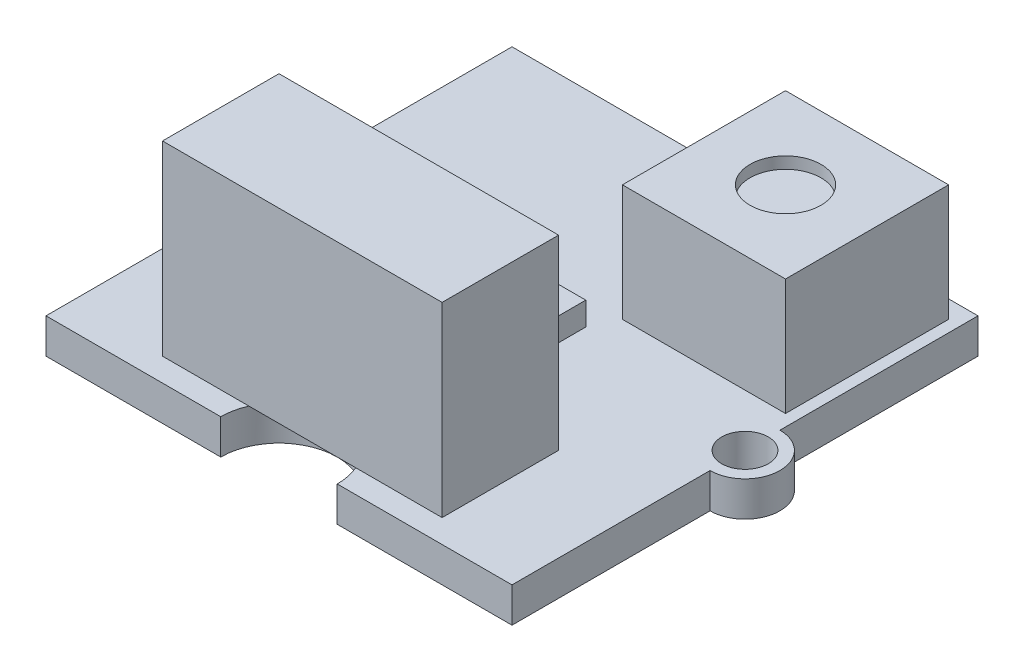
ISO-10303-21;
HEADER;
FILE_DESCRIPTION(('STEP AP214'),'2;1');
FILE_NAME('part.step','',(''),(''),'','','');
FILE_SCHEMA(('AUTOMOTIVE_DESIGN { 1 0 10303 214 1 1 1 1 }'));
ENDSEC;
DATA;
#1=APPLICATION_CONTEXT('core data for automotive mechanical design processes');
#2=APPLICATION_PROTOCOL_DEFINITION('international standard','automotive_design',2000,#1);
#3=PRODUCT_CONTEXT('',#1,'mechanical');
#4=PRODUCT('Part','Part','',(#3));
#5=PRODUCT_RELATED_PRODUCT_CATEGORY('part','',(#4));
#6=PRODUCT_DEFINITION_FORMATION('','',#4);
#7=PRODUCT_DEFINITION_CONTEXT('part definition',#1,'design');
#8=PRODUCT_DEFINITION('design','',#6,#7);
#9=PRODUCT_DEFINITION_SHAPE('','',#8);
#10=(LENGTH_UNIT() NAMED_UNIT(*) SI_UNIT(.MILLI.,.METRE.));
#11=(NAMED_UNIT(*) PLANE_ANGLE_UNIT() SI_UNIT($,.RADIAN.));
#12=(NAMED_UNIT(*) SI_UNIT($,.STERADIAN.) SOLID_ANGLE_UNIT());
#13=UNCERTAINTY_MEASURE_WITH_UNIT(LENGTH_MEASURE(1.E-05),#10,'distance_accuracy_value','');
#14=(GEOMETRIC_REPRESENTATION_CONTEXT(3) GLOBAL_UNCERTAINTY_ASSIGNED_CONTEXT((#13)) GLOBAL_UNIT_ASSIGNED_CONTEXT((#10,
#11,#12)) REPRESENTATION_CONTEXT('',''));
#15=CARTESIAN_POINT('',(0.,0.,0.));
#16=DIRECTION('',(0.,0.,1.));
#17=DIRECTION('',(1.,0.,0.));
#18=AXIS2_PLACEMENT_3D('',#15,#16,#17);
#19=CARTESIAN_POINT('',(0.,1.5,0.));
#20=DIRECTION('',(0.,1.,0.));
#21=DIRECTION('',(0.,0.,1.));
#22=AXIS2_PLACEMENT_3D('',#19,#20,#21);
#23=PLANE('',#22);
#24=DIRECTION('',(1.,0.,0.));
#25=VECTOR('',#24,1.);
#26=CARTESIAN_POINT('',(-6.,1.5,9.));
#27=LINE('',#26,#25);
#28=CARTESIAN_POINT('',(2.29128784747792,1.5,9.));
#29=VERTEX_POINT('',#28);
#30=CARTESIAN_POINT('',(6.,1.5,9.));
#31=VERTEX_POINT('',#30);
#32=EDGE_CURVE('E11',#29,#31,#27,.T.);
#33=ORIENTED_EDGE('',*,*,#32,.F.);
#34=CARTESIAN_POINT('',(0.,1.5,10.));
#35=DIRECTION('',(0.,1.,0.));
#36=DIRECTION('',(0.,0.,1.));
#37=AXIS2_PLACEMENT_3D('',#34,#35,#36);
#38=CIRCLE('',#37,2.5);
#39=CARTESIAN_POINT('',(2.5,1.5,10.));
#40=VERTEX_POINT('',#39);
#41=EDGE_CURVE('E301',#40,#29,#38,.T.);
#42=ORIENTED_EDGE('',*,*,#41,.F.);
#43=DIRECTION('',(1.,0.,0.));
#44=VECTOR('',#43,1.);
#45=CARTESIAN_POINT('',(-10.,1.5,10.));
#46=LINE('',#45,#44);
#47=CARTESIAN_POINT('',(10.,1.5,10.));
#48=VERTEX_POINT('',#47);
#49=EDGE_CURVE('E363',#40,#48,#46,.T.);
#50=ORIENTED_EDGE('',*,*,#49,.T.);
#51=DIRECTION('',(0.,0.,-1.));
#52=VECTOR('',#51,1.);
#53=CARTESIAN_POINT('',(10.,1.5,-10.));
#54=LINE('',#53,#52);
#55=CARTESIAN_POINT('',(10.,1.5,1.5));
#56=VERTEX_POINT('',#55);
#57=EDGE_CURVE('E351',#48,#56,#54,.T.);
#58=ORIENTED_EDGE('',*,*,#57,.T.);
#59=CARTESIAN_POINT('',(10.,1.5,0.));
#60=DIRECTION('',(0.,1.,0.));
#61=DIRECTION('',(0.,0.,1.));
#62=AXIS2_PLACEMENT_3D('',#59,#60,#61);
#63=CIRCLE('',#62,1.5);
#64=CARTESIAN_POINT('',(10.,1.5,-1.5));
#65=VERTEX_POINT('',#64);
#66=EDGE_CURVE('E328',#56,#65,#63,.T.);
#67=ORIENTED_EDGE('',*,*,#66,.T.);
#68=CARTESIAN_POINT('',(10.,1.5,-10.));
#69=VERTEX_POINT('',#68);
#70=EDGE_CURVE('E355',#65,#69,#54,.T.);
#71=ORIENTED_EDGE('',*,*,#70,.T.);
#72=DIRECTION('',(-1.,0.,0.));
#73=VECTOR('',#72,1.);
#74=CARTESIAN_POINT('',(-10.,1.5,-10.));
#75=LINE('',#74,#73);
#76=CARTESIAN_POINT('',(2.5,1.5,-10.));
#77=VERTEX_POINT('',#76);
#78=EDGE_CURVE('E356',#69,#77,#75,.T.);
#79=ORIENTED_EDGE('',*,*,#78,.T.);
#80=CARTESIAN_POINT('',(0.,1.5,-10.));
#81=DIRECTION('',(0.,1.,0.));
#82=DIRECTION('',(0.,0.,1.));
#83=AXIS2_PLACEMENT_3D('',#80,#81,#82);
#84=CIRCLE('',#83,2.5);
#85=CARTESIAN_POINT('',(-2.5,1.5,-10.));
#86=VERTEX_POINT('',#85);
#87=EDGE_CURVE('E310',#86,#77,#84,.T.);
#88=ORIENTED_EDGE('',*,*,#87,.F.);
#89=CARTESIAN_POINT('',(-10.,1.5,-10.));
#90=VERTEX_POINT('',#89);
#91=EDGE_CURVE('E354',#86,#90,#75,.T.);
#92=ORIENTED_EDGE('',*,*,#91,.T.);
#93=DIRECTION('',(0.,0.,1.));
#94=VECTOR('',#93,1.);
#95=CARTESIAN_POINT('',(-10.,1.5,-10.));
#96=LINE('',#95,#94);
#97=CARTESIAN_POINT('',(-10.,1.5,-1.5));
#98=VERTEX_POINT('',#97);
#99=EDGE_CURVE('E360',#90,#98,#96,.T.);
#100=ORIENTED_EDGE('',*,*,#99,.T.);
#101=CARTESIAN_POINT('',(-10.,1.5,0.));
#102=DIRECTION('',(0.,1.,0.));
#103=DIRECTION('',(0.,0.,1.));
#104=AXIS2_PLACEMENT_3D('',#101,#102,#103);
#105=CIRCLE('',#104,1.5);
#106=CARTESIAN_POINT('',(-10.,1.5,1.5));
#107=VERTEX_POINT('',#106);
#108=EDGE_CURVE('E340',#98,#107,#105,.T.);
#109=ORIENTED_EDGE('',*,*,#108,.T.);
#110=CARTESIAN_POINT('',(-10.,1.5,10.));
#111=VERTEX_POINT('',#110);
#112=EDGE_CURVE('E359',#107,#111,#96,.T.);
#113=ORIENTED_EDGE('',*,*,#112,.T.);
#114=CARTESIAN_POINT('',(-2.5,1.5,10.));
#115=VERTEX_POINT('',#114);
#116=EDGE_CURVE('E364',#111,#115,#46,.T.);
#117=ORIENTED_EDGE('',*,*,#116,.T.);
#118=CARTESIAN_POINT('',(-2.29128784747792,1.5,9.));
#119=VERTEX_POINT('',#118);
#120=EDGE_CURVE('E296',#119,#115,#38,.T.);
#121=ORIENTED_EDGE('',*,*,#120,.F.);
#122=CARTESIAN_POINT('',(-6.,1.5,9.));
#123=VERTEX_POINT('',#122);
#124=EDGE_CURVE('E42',#123,#119,#27,.T.);
#125=ORIENTED_EDGE('',*,*,#124,.F.);
#126=DIRECTION('',(0.,0.,1.));
#127=VECTOR('',#126,1.);
#128=CARTESIAN_POINT('',(-6.,1.5,4.));
#129=LINE('',#128,#127);
#130=CARTESIAN_POINT('',(-6.,1.5,4.));
#131=VERTEX_POINT('',#130);
#132=EDGE_CURVE('E281',#131,#123,#129,.T.);
#133=ORIENTED_EDGE('',*,*,#132,.F.);
#134=DIRECTION('',(-1.,0.,0.));
#135=VECTOR('',#134,1.);
#136=CARTESIAN_POINT('',(-6.,1.5,4.));
#137=LINE('',#136,#135);
#138=CARTESIAN_POINT('',(6.,1.5,4.));
#139=VERTEX_POINT('',#138);
#140=EDGE_CURVE('E278',#139,#131,#137,.T.);
#141=ORIENTED_EDGE('',*,*,#140,.F.);
#142=DIRECTION('',(0.,0.,-1.));
#143=VECTOR('',#142,1.);
#144=CARTESIAN_POINT('',(6.,1.5,4.));
#145=LINE('',#144,#143);
#146=EDGE_CURVE('E265',#31,#139,#145,.T.);
#147=ORIENTED_EDGE('',*,*,#146,.F.);
#148=EDGE_LOOP('',(#33,#42,#50,#58,#67,#71,#79,#88,#92,#100,#109,#113,#117,#121,#125,#133,#141,#147));
#149=FACE_BOUND('',#148,.T.);
#150=CARTESIAN_POINT('',(10.,1.5,0.));
#151=DIRECTION('',(0.,1.,0.));
#152=DIRECTION('',(0.,0.,1.));
#153=AXIS2_PLACEMENT_3D('',#150,#151,#152);
#154=CIRCLE('',#153,1.);
#155=CARTESIAN_POINT('',(10.,1.5,0.999999999999996));
#156=VERTEX_POINT('',#155);
#157=EDGE_CURVE('E318',#156,#156,#154,.T.);
#158=ORIENTED_EDGE('',*,*,#157,.F.);
#159=EDGE_LOOP('',(#158));
#160=FACE_BOUND('',#159,.T.);
#161=CARTESIAN_POINT('',(-10.,1.5,0.));
#162=DIRECTION('',(0.,1.,0.));
#163=DIRECTION('',(0.,0.,1.));
#164=AXIS2_PLACEMENT_3D('',#161,#162,#163);
#165=CIRCLE('',#164,1.);
#166=CARTESIAN_POINT('',(-10.,1.5,0.999999999999996));
#167=VERTEX_POINT('',#166);
#168=EDGE_CURVE('E322',#167,#167,#165,.T.);
#169=ORIENTED_EDGE('',*,*,#168,.F.);
#170=EDGE_LOOP('',(#169));
#171=FACE_BOUND('',#170,.T.);
#172=DIRECTION('',(-1.,0.,0.));
#173=VECTOR('',#172,1.);
#174=CARTESIAN_POINT('',(2.5,1.5,-9.23875388606364));
#175=LINE('',#174,#173);
#176=CARTESIAN_POINT('',(9.5,1.5,-9.23875388606364));
#177=VERTEX_POINT('',#176);
#178=CARTESIAN_POINT('',(2.5,1.5,-9.23875388606364));
#179=VERTEX_POINT('',#178);
#180=EDGE_CURVE('E252',#177,#179,#175,.T.);
#181=ORIENTED_EDGE('',*,*,#180,.F.);
#182=DIRECTION('',(0.,0.,-1.));
#183=VECTOR('',#182,1.);
#184=CARTESIAN_POINT('',(9.5,1.5,-9.23875388606364));
#185=LINE('',#184,#183);
#186=CARTESIAN_POINT('',(9.5,1.5,-2.23875388606364));
#187=VERTEX_POINT('',#186);
#188=EDGE_CURVE('E237',#187,#177,#185,.T.);
#189=ORIENTED_EDGE('',*,*,#188,.F.);
#190=DIRECTION('',(1.,0.,0.));
#191=VECTOR('',#190,1.);
#192=CARTESIAN_POINT('',(2.5,1.5,-2.23875388606364));
#193=LINE('',#192,#191);
#194=CARTESIAN_POINT('',(2.5,1.5,-2.23875388606364));
#195=VERTEX_POINT('',#194);
#196=EDGE_CURVE('E243',#195,#187,#193,.T.);
#197=ORIENTED_EDGE('',*,*,#196,.F.);
#198=DIRECTION('',(0.,0.,1.));
#199=VECTOR('',#198,1.);
#200=CARTESIAN_POINT('',(2.5,1.5,-9.23875388606364));
#201=LINE('',#200,#199);
#202=EDGE_CURVE('E254',#179,#195,#201,.T.);
#203=ORIENTED_EDGE('',*,*,#202,.F.);
#204=EDGE_LOOP('',(#181,#189,#197,#203));
#205=FACE_BOUND('',#204,.T.);
#206=DIRECTION('',(-1.,0.,0.));
#207=VECTOR('',#206,1.);
#208=CARTESIAN_POINT('',(-3.,1.5,-1.16720873507012));
#209=LINE('',#208,#207);
#210=CARTESIAN_POINT('',(2.,1.5,-1.16720873507012));
#211=VERTEX_POINT('',#210);
#212=CARTESIAN_POINT('',(-3.,1.5,-1.16720873507012));
#213=VERTEX_POINT('',#212);
#214=EDGE_CURVE('E749',#211,#213,#209,.T.);
#215=ORIENTED_EDGE('',*,*,#214,.F.);
#216=DIRECTION('',(0.,0.,-1.));
#217=VECTOR('',#216,1.);
#218=CARTESIAN_POINT('',(2.,1.5,-1.16720873507012));
#219=LINE('',#218,#217);
#220=CARTESIAN_POINT('',(2.,1.5,2.33279126492988));
#221=VERTEX_POINT('',#220);
#222=EDGE_CURVE('E226',#221,#211,#219,.T.);
#223=ORIENTED_EDGE('',*,*,#222,.F.);
#224=DIRECTION('',(1.,0.,0.));
#225=VECTOR('',#224,1.);
#226=CARTESIAN_POINT('',(-3.,1.5,2.33279126492988));
#227=LINE('',#226,#225);
#228=CARTESIAN_POINT('',(-3.,1.5,2.33279126492988));
#229=VERTEX_POINT('',#228);
#230=EDGE_CURVE('E222',#229,#221,#227,.T.);
#231=ORIENTED_EDGE('',*,*,#230,.F.);
#232=DIRECTION('',(0.,0.,1.));
#233=VECTOR('',#232,1.);
#234=CARTESIAN_POINT('',(-3.,1.5,-1.16720873507012));
#235=LINE('',#234,#233);
#236=EDGE_CURVE('E746',#213,#229,#235,.T.);
#237=ORIENTED_EDGE('',*,*,#236,.F.);
#238=EDGE_LOOP('',(#215,#223,#231,#237));
#239=FACE_BOUND('',#238,.T.);
#240=ADVANCED_FACE('F32',(#149,#160,#171,#205,#239),#23,.T.);
#241=CARTESIAN_POINT('',(-10.,1.5,10.));
#242=DIRECTION('',(0.,0.,-1.));
#243=DIRECTION('',(-1.,0.,0.));
#244=AXIS2_PLACEMENT_3D('',#241,#242,#243);
#245=PLANE('',#244);
#246=DIRECTION('',(1.,0.,0.));
#247=VECTOR('',#246,1.);
#248=CARTESIAN_POINT('',(-10.,0.,10.));
#249=LINE('',#248,#247);
#250=CARTESIAN_POINT('',(-10.,0.,10.));
#251=VERTEX_POINT('',#250);
#252=CARTESIAN_POINT('',(-2.5,0.,10.));
#253=VERTEX_POINT('',#252);
#254=EDGE_CURVE('E380',#251,#253,#249,.T.);
#255=ORIENTED_EDGE('',*,*,#254,.T.);
#256=DIRECTION('',(0.,1.,0.));
#257=VECTOR('',#256,1.);
#258=CARTESIAN_POINT('',(-2.5,0.,10.));
#259=LINE('',#258,#257);
#260=EDGE_CURVE('E307',#253,#115,#259,.T.);
#261=ORIENTED_EDGE('',*,*,#260,.T.);
#262=ORIENTED_EDGE('',*,*,#116,.F.);
#263=DIRECTION('',(0.,-1.,0.));
#264=VECTOR('',#263,1.);
#265=CARTESIAN_POINT('',(-10.,1.5,10.));
#266=LINE('',#265,#264);
#267=EDGE_CURVE('E385',#111,#251,#266,.T.);
#268=ORIENTED_EDGE('',*,*,#267,.T.);
#269=EDGE_LOOP('',(#255,#261,#262,#268));
#270=FACE_BOUND('',#269,.T.);
#271=ADVANCED_FACE('F426',(#270),#245,.F.);
#272=CARTESIAN_POINT('',(-10.,1.5,-10.));
#273=DIRECTION('',(0.,0.,1.));
#274=DIRECTION('',(1.,0.,0.));
#275=AXIS2_PLACEMENT_3D('',#272,#273,#274);
#276=PLANE('',#275);
#277=DIRECTION('',(-1.,0.,0.));
#278=VECTOR('',#277,1.);
#279=CARTESIAN_POINT('',(-10.,0.,-10.));
#280=LINE('',#279,#278);
#281=CARTESIAN_POINT('',(10.,0.,-10.));
#282=VERTEX_POINT('',#281);
#283=CARTESIAN_POINT('',(2.5,0.,-10.));
#284=VERTEX_POINT('',#283);
#285=EDGE_CURVE('E372',#282,#284,#280,.T.);
#286=ORIENTED_EDGE('',*,*,#285,.T.);
#287=DIRECTION('',(0.,1.,0.));
#288=VECTOR('',#287,1.);
#289=CARTESIAN_POINT('',(2.5,0.,-10.));
#290=LINE('',#289,#288);
#291=EDGE_CURVE('E315',#284,#77,#290,.T.);
#292=ORIENTED_EDGE('',*,*,#291,.T.);
#293=ORIENTED_EDGE('',*,*,#78,.F.);
#294=DIRECTION('',(0.,-1.,0.));
#295=VECTOR('',#294,1.);
#296=CARTESIAN_POINT('',(10.,1.5,-10.));
#297=LINE('',#296,#295);
#298=EDGE_CURVE('E390',#69,#282,#297,.T.);
#299=ORIENTED_EDGE('',*,*,#298,.T.);
#300=EDGE_LOOP('',(#286,#292,#293,#299));
#301=FACE_BOUND('',#300,.T.);
#302=ADVANCED_FACE('F404',(#301),#276,.F.);
#303=CARTESIAN_POINT('',(10.,1.5,-10.));
#304=DIRECTION('',(-1.,0.,0.));
#305=DIRECTION('',(0.,0.,1.));
#306=AXIS2_PLACEMENT_3D('',#303,#304,#305);
#307=PLANE('',#306);
#308=DIRECTION('',(0.,0.,-1.));
#309=VECTOR('',#308,1.);
#310=CARTESIAN_POINT('',(10.,0.,-10.));
#311=LINE('',#310,#309);
#312=CARTESIAN_POINT('',(10.,0.,10.));
#313=VERTEX_POINT('',#312);
#314=CARTESIAN_POINT('',(10.,0.,1.5));
#315=VERTEX_POINT('',#314);
#316=EDGE_CURVE('E368',#313,#315,#311,.T.);
#317=ORIENTED_EDGE('',*,*,#316,.T.);
#318=DIRECTION('',(0.,1.,0.));
#319=VECTOR('',#318,1.);
#320=CARTESIAN_POINT('',(10.,0.,1.5));
#321=LINE('',#320,#319);
#322=EDGE_CURVE('E337',#315,#56,#321,.T.);
#323=ORIENTED_EDGE('',*,*,#322,.T.);
#324=ORIENTED_EDGE('',*,*,#57,.F.);
#325=DIRECTION('',(0.,-1.,0.));
#326=VECTOR('',#325,1.);
#327=CARTESIAN_POINT('',(10.,1.5,10.));
#328=LINE('',#327,#326);
#329=EDGE_CURVE('E367',#48,#313,#328,.T.);
#330=ORIENTED_EDGE('',*,*,#329,.T.);
#331=EDGE_LOOP('',(#317,#323,#324,#330));
#332=FACE_BOUND('',#331,.T.);
#333=ADVANCED_FACE('F416',(#332),#307,.F.);
#334=CARTESIAN_POINT('',(-10.,1.5,-10.));
#335=DIRECTION('',(1.,0.,0.));
#336=DIRECTION('',(0.,0.,-1.));
#337=AXIS2_PLACEMENT_3D('',#334,#335,#336);
#338=PLANE('',#337);
#339=DIRECTION('',(0.,0.,1.));
#340=VECTOR('',#339,1.);
#341=CARTESIAN_POINT('',(-10.,0.,-10.));
#342=LINE('',#341,#340);
#343=CARTESIAN_POINT('',(-10.,0.,-10.));
#344=VERTEX_POINT('',#343);
#345=CARTESIAN_POINT('',(-10.,0.,-1.5));
#346=VERTEX_POINT('',#345);
#347=EDGE_CURVE('E376',#344,#346,#342,.T.);
#348=ORIENTED_EDGE('',*,*,#347,.T.);
#349=DIRECTION('',(0.,1.,0.));
#350=VECTOR('',#349,1.);
#351=CARTESIAN_POINT('',(-10.,0.,-1.5));
#352=LINE('',#351,#350);
#353=EDGE_CURVE('E347',#346,#98,#352,.T.);
#354=ORIENTED_EDGE('',*,*,#353,.T.);
#355=ORIENTED_EDGE('',*,*,#99,.F.);
#356=DIRECTION('',(0.,-1.,0.));
#357=VECTOR('',#356,1.);
#358=CARTESIAN_POINT('',(-10.,1.5,-10.));
#359=LINE('',#358,#357);
#360=EDGE_CURVE('E388',#90,#344,#359,.T.);
#361=ORIENTED_EDGE('',*,*,#360,.T.);
#362=EDGE_LOOP('',(#348,#354,#355,#361));
#363=FACE_BOUND('',#362,.T.);
#364=ADVANCED_FACE('F436',(#363),#338,.F.);
#365=ORIENTED_EDGE('',*,*,#70,.F.);
#366=DIRECTION('',(0.,1.,0.));
#367=VECTOR('',#366,1.);
#368=CARTESIAN_POINT('',(10.,0.,-1.5));
#369=LINE('',#368,#367);
#370=CARTESIAN_POINT('',(10.,0.,-1.5));
#371=VERTEX_POINT('',#370);
#372=EDGE_CURVE('E333',#65,#371,#369,.F.);
#373=ORIENTED_EDGE('',*,*,#372,.T.);
#374=EDGE_CURVE('E350',#371,#282,#311,.T.);
#375=ORIENTED_EDGE('',*,*,#374,.T.);
#376=ORIENTED_EDGE('',*,*,#298,.F.);
#377=EDGE_LOOP('',(#365,#373,#375,#376));
#378=FACE_BOUND('',#377,.T.);
#379=ADVANCED_FACE('F34',(#378),#307,.F.);
#380=ORIENTED_EDGE('',*,*,#91,.F.);
#381=DIRECTION('',(0.,1.,0.));
#382=VECTOR('',#381,1.);
#383=CARTESIAN_POINT('',(-2.5,0.,-10.));
#384=LINE('',#383,#382);
#385=CARTESIAN_POINT('',(-2.5,0.,-10.));
#386=VERTEX_POINT('',#385);
#387=EDGE_CURVE('E312',#86,#386,#384,.F.);
#388=ORIENTED_EDGE('',*,*,#387,.T.);
#389=EDGE_CURVE('E371',#386,#344,#280,.T.);
#390=ORIENTED_EDGE('',*,*,#389,.T.);
#391=ORIENTED_EDGE('',*,*,#360,.F.);
#392=EDGE_LOOP('',(#380,#388,#390,#391));
#393=FACE_BOUND('',#392,.T.);
#394=ADVANCED_FACE('F440',(#393),#276,.F.);
#395=ORIENTED_EDGE('',*,*,#112,.F.);
#396=DIRECTION('',(0.,1.,0.));
#397=VECTOR('',#396,1.);
#398=CARTESIAN_POINT('',(-10.,0.,1.5));
#399=LINE('',#398,#397);
#400=CARTESIAN_POINT('',(-10.,0.,1.5));
#401=VERTEX_POINT('',#400);
#402=EDGE_CURVE('E343',#107,#401,#399,.F.);
#403=ORIENTED_EDGE('',*,*,#402,.T.);
#404=EDGE_CURVE('E375',#401,#251,#342,.T.);
#405=ORIENTED_EDGE('',*,*,#404,.T.);
#406=ORIENTED_EDGE('',*,*,#267,.F.);
#407=EDGE_LOOP('',(#395,#403,#405,#406));
#408=FACE_BOUND('',#407,.T.);
#409=ADVANCED_FACE('F431',(#408),#338,.F.);
#410=ORIENTED_EDGE('',*,*,#49,.F.);
#411=DIRECTION('',(0.,1.,0.));
#412=VECTOR('',#411,1.);
#413=CARTESIAN_POINT('',(2.5,0.,10.));
#414=LINE('',#413,#412);
#415=CARTESIAN_POINT('',(2.5,0.,10.));
#416=VERTEX_POINT('',#415);
#417=EDGE_CURVE('E300',#40,#416,#414,.F.);
#418=ORIENTED_EDGE('',*,*,#417,.T.);
#419=EDGE_CURVE('E379',#416,#313,#249,.T.);
#420=ORIENTED_EDGE('',*,*,#419,.T.);
#421=ORIENTED_EDGE('',*,*,#329,.F.);
#422=EDGE_LOOP('',(#410,#418,#420,#421));
#423=FACE_BOUND('',#422,.T.);
#424=ADVANCED_FACE('F421',(#423),#245,.F.);
#425=CARTESIAN_POINT('',(0.,0.,0.));
#426=DIRECTION('',(0.,1.,0.));
#427=DIRECTION('',(0.,0.,1.));
#428=AXIS2_PLACEMENT_3D('',#425,#426,#427);
#429=PLANE('',#428);
#430=CARTESIAN_POINT('',(10.,0.,0.));
#431=DIRECTION('',(0.,1.,0.));
#432=DIRECTION('',(0.,0.,1.));
#433=AXIS2_PLACEMENT_3D('',#430,#431,#432);
#434=CIRCLE('',#433,1.);
#435=CARTESIAN_POINT('',(10.,0.,0.999999999999996));
#436=VERTEX_POINT('',#435);
#437=EDGE_CURVE('E319',#436,#436,#434,.T.);
#438=ORIENTED_EDGE('',*,*,#437,.T.);
#439=EDGE_LOOP('',(#438));
#440=FACE_BOUND('',#439,.T.);
#441=CARTESIAN_POINT('',(-10.,0.,0.));
#442=DIRECTION('',(0.,1.,0.));
#443=DIRECTION('',(0.,0.,1.));
#444=AXIS2_PLACEMENT_3D('',#441,#442,#443);
#445=CIRCLE('',#444,1.);
#446=CARTESIAN_POINT('',(-10.,0.,0.999999999999996));
#447=VERTEX_POINT('',#446);
#448=EDGE_CURVE('E325',#447,#447,#445,.T.);
#449=ORIENTED_EDGE('',*,*,#448,.T.);
#450=EDGE_LOOP('',(#449));
#451=FACE_BOUND('',#450,.T.);
#452=ORIENTED_EDGE('',*,*,#419,.F.);
#453=CARTESIAN_POINT('',(0.,0.,10.));
#454=DIRECTION('',(0.,1.,0.));
#455=DIRECTION('',(0.,0.,1.));
#456=AXIS2_PLACEMENT_3D('',#453,#454,#455);
#457=CIRCLE('',#456,2.5);
#458=EDGE_CURVE('E297',#416,#253,#457,.T.);
#459=ORIENTED_EDGE('',*,*,#458,.T.);
#460=ORIENTED_EDGE('',*,*,#254,.F.);
#461=ORIENTED_EDGE('',*,*,#404,.F.);
#462=CARTESIAN_POINT('',(-10.,0.,0.));
#463=DIRECTION('',(0.,1.,0.));
#464=DIRECTION('',(0.,0.,1.));
#465=AXIS2_PLACEMENT_3D('',#462,#463,#464);
#466=CIRCLE('',#465,1.5);
#467=EDGE_CURVE('E341',#346,#401,#466,.T.);
#468=ORIENTED_EDGE('',*,*,#467,.F.);
#469=ORIENTED_EDGE('',*,*,#347,.F.);
#470=ORIENTED_EDGE('',*,*,#389,.F.);
#471=CARTESIAN_POINT('',(0.,0.,-10.));
#472=DIRECTION('',(0.,1.,0.));
#473=DIRECTION('',(0.,0.,1.));
#474=AXIS2_PLACEMENT_3D('',#471,#472,#473);
#475=CIRCLE('',#474,2.5);
#476=EDGE_CURVE('E36',#386,#284,#475,.T.);
#477=ORIENTED_EDGE('',*,*,#476,.T.);
#478=ORIENTED_EDGE('',*,*,#285,.F.);
#479=ORIENTED_EDGE('',*,*,#374,.F.);
#480=CARTESIAN_POINT('',(10.,0.,0.));
#481=DIRECTION('',(0.,1.,0.));
#482=DIRECTION('',(0.,0.,1.));
#483=AXIS2_PLACEMENT_3D('',#480,#481,#482);
#484=CIRCLE('',#483,1.5);
#485=EDGE_CURVE('E331',#315,#371,#484,.T.);
#486=ORIENTED_EDGE('',*,*,#485,.F.);
#487=ORIENTED_EDGE('',*,*,#316,.F.);
#488=EDGE_LOOP('',(#452,#459,#460,#461,#468,#469,#470,#477,#478,#479,#486,#487));
#489=FACE_BOUND('',#488,.T.);
#490=ADVANCED_FACE('F400',(#440,#451,#489),#429,.F.);
#491=CARTESIAN_POINT('',(-10.,0.,0.));
#492=DIRECTION('',(0.,1.,0.));
#493=DIRECTION('',(0.,0.,1.));
#494=AXIS2_PLACEMENT_3D('',#491,#492,#493);
#495=CYLINDRICAL_SURFACE('',#494,1.5);
#496=ORIENTED_EDGE('',*,*,#353,.F.);
#497=ORIENTED_EDGE('',*,*,#467,.T.);
#498=ORIENTED_EDGE('',*,*,#402,.F.);
#499=ORIENTED_EDGE('',*,*,#108,.F.);
#500=EDGE_LOOP('',(#496,#497,#498,#499));
#501=FACE_BOUND('',#500,.T.);
#502=ADVANCED_FACE('F463',(#501),#495,.T.);
#503=CARTESIAN_POINT('',(10.,0.,0.));
#504=DIRECTION('',(0.,1.,0.));
#505=DIRECTION('',(0.,0.,1.));
#506=AXIS2_PLACEMENT_3D('',#503,#504,#505);
#507=CYLINDRICAL_SURFACE('',#506,1.5);
#508=ORIENTED_EDGE('',*,*,#322,.F.);
#509=ORIENTED_EDGE('',*,*,#485,.T.);
#510=ORIENTED_EDGE('',*,*,#372,.F.);
#511=ORIENTED_EDGE('',*,*,#66,.F.);
#512=EDGE_LOOP('',(#508,#509,#510,#511));
#513=FACE_BOUND('',#512,.T.);
#514=ADVANCED_FACE('F504',(#513),#507,.T.);
#515=CARTESIAN_POINT('',(-10.,0.,0.));
#516=DIRECTION('',(0.,1.,0.));
#517=DIRECTION('',(0.,0.,1.));
#518=AXIS2_PLACEMENT_3D('',#515,#516,#517);
#519=CYLINDRICAL_SURFACE('',#518,1.);
#520=ORIENTED_EDGE('',*,*,#448,.F.);
#521=EDGE_LOOP('',(#520));
#522=FACE_BOUND('',#521,.T.);
#523=ORIENTED_EDGE('',*,*,#168,.T.);
#524=EDGE_LOOP('',(#523));
#525=FACE_BOUND('',#524,.T.);
#526=ADVANCED_FACE('F452',(#522,#525),#519,.F.);
#527=CARTESIAN_POINT('',(10.,0.,0.));
#528=DIRECTION('',(0.,1.,0.));
#529=DIRECTION('',(0.,0.,1.));
#530=AXIS2_PLACEMENT_3D('',#527,#528,#529);
#531=CYLINDRICAL_SURFACE('',#530,1.);
#532=ORIENTED_EDGE('',*,*,#437,.F.);
#533=EDGE_LOOP('',(#532));
#534=FACE_BOUND('',#533,.T.);
#535=ORIENTED_EDGE('',*,*,#157,.T.);
#536=EDGE_LOOP('',(#535));
#537=FACE_BOUND('',#536,.T.);
#538=ADVANCED_FACE('F444',(#534,#537),#531,.F.);
#539=CARTESIAN_POINT('',(0.,0.,-10.));
#540=DIRECTION('',(0.,1.,0.));
#541=DIRECTION('',(0.,0.,1.));
#542=AXIS2_PLACEMENT_3D('',#539,#540,#541);
#543=CYLINDRICAL_SURFACE('',#542,2.5);
#544=ORIENTED_EDGE('',*,*,#476,.F.);
#545=ORIENTED_EDGE('',*,*,#387,.F.);
#546=ORIENTED_EDGE('',*,*,#87,.T.);
#547=ORIENTED_EDGE('',*,*,#291,.F.);
#548=EDGE_LOOP('',(#544,#545,#546,#547));
#549=FACE_BOUND('',#548,.T.);
#550=ADVANCED_FACE('F441',(#549),#543,.F.);
#551=CARTESIAN_POINT('',(0.,0.,10.));
#552=DIRECTION('',(0.,1.,0.));
#553=DIRECTION('',(0.,0.,1.));
#554=AXIS2_PLACEMENT_3D('',#551,#552,#553);
#555=CYLINDRICAL_SURFACE('',#554,2.5);
#556=ORIENTED_EDGE('',*,*,#458,.F.);
#557=ORIENTED_EDGE('',*,*,#417,.F.);
#558=ORIENTED_EDGE('',*,*,#41,.T.);
#559=EDGE_CURVE('E304',#29,#119,#38,.T.);
#560=ORIENTED_EDGE('',*,*,#559,.T.);
#561=ORIENTED_EDGE('',*,*,#120,.T.);
#562=ORIENTED_EDGE('',*,*,#260,.F.);
#563=EDGE_LOOP('',(#556,#557,#558,#560,#561,#562));
#564=FACE_BOUND('',#563,.T.);
#565=ADVANCED_FACE('F443',(#564),#555,.F.);
#566=CARTESIAN_POINT('',(6.,9.5,4.));
#567=DIRECTION('',(-1.,0.,0.));
#568=DIRECTION('',(0.,0.,1.));
#569=AXIS2_PLACEMENT_3D('',#566,#567,#568);
#570=PLANE('',#569);
#571=ORIENTED_EDGE('',*,*,#146,.T.);
#572=DIRECTION('',(0.,-1.,0.));
#573=VECTOR('',#572,1.);
#574=CARTESIAN_POINT('',(6.,9.5,4.));
#575=LINE('',#574,#573);
#576=CARTESIAN_POINT('',(6.,9.5,4.));
#577=VERTEX_POINT('',#576);
#578=EDGE_CURVE('E293',#577,#139,#575,.T.);
#579=ORIENTED_EDGE('',*,*,#578,.F.);
#580=DIRECTION('',(0.,0.,-1.));
#581=VECTOR('',#580,1.);
#582=CARTESIAN_POINT('',(6.,9.5,4.));
#583=LINE('',#582,#581);
#584=CARTESIAN_POINT('',(6.,9.5,9.));
#585=VERTEX_POINT('',#584);
#586=EDGE_CURVE('E266',#585,#577,#583,.T.);
#587=ORIENTED_EDGE('',*,*,#586,.F.);
#588=DIRECTION('',(0.,-1.,0.));
#589=VECTOR('',#588,1.);
#590=CARTESIAN_POINT('',(6.,9.5,9.));
#591=LINE('',#590,#589);
#592=EDGE_CURVE('E275',#585,#31,#591,.T.);
#593=ORIENTED_EDGE('',*,*,#592,.T.);
#594=EDGE_LOOP('',(#571,#579,#587,#593));
#595=FACE_BOUND('',#594,.T.);
#596=ADVANCED_FACE('F450',(#595),#570,.F.);
#597=CARTESIAN_POINT('',(-6.,9.5,4.));
#598=DIRECTION('',(0.,0.,1.));
#599=DIRECTION('',(1.,0.,0.));
#600=AXIS2_PLACEMENT_3D('',#597,#598,#599);
#601=PLANE('',#600);
#602=ORIENTED_EDGE('',*,*,#140,.T.);
#603=DIRECTION('',(0.,-1.,0.));
#604=VECTOR('',#603,1.);
#605=CARTESIAN_POINT('',(-6.,9.5,4.));
#606=LINE('',#605,#604);
#607=CARTESIAN_POINT('',(-6.,9.5,4.));
#608=VERTEX_POINT('',#607);
#609=EDGE_CURVE('E290',#608,#131,#606,.T.);
#610=ORIENTED_EDGE('',*,*,#609,.F.);
#611=DIRECTION('',(-1.,0.,0.));
#612=VECTOR('',#611,1.);
#613=CARTESIAN_POINT('',(-6.,9.5,4.));
#614=LINE('',#613,#612);
#615=EDGE_CURVE('E269',#577,#608,#614,.T.);
#616=ORIENTED_EDGE('',*,*,#615,.F.);
#617=ORIENTED_EDGE('',*,*,#578,.T.);
#618=EDGE_LOOP('',(#602,#610,#616,#617));
#619=FACE_BOUND('',#618,.T.);
#620=ADVANCED_FACE('F570',(#619),#601,.F.);
#621=CARTESIAN_POINT('',(-6.,9.5,4.));
#622=DIRECTION('',(1.,0.,0.));
#623=DIRECTION('',(0.,0.,-1.));
#624=AXIS2_PLACEMENT_3D('',#621,#622,#623);
#625=PLANE('',#624);
#626=ORIENTED_EDGE('',*,*,#132,.T.);
#627=DIRECTION('',(0.,-1.,0.));
#628=VECTOR('',#627,1.);
#629=CARTESIAN_POINT('',(-6.,9.5,9.));
#630=LINE('',#629,#628);
#631=CARTESIAN_POINT('',(-6.,9.5,9.));
#632=VERTEX_POINT('',#631);
#633=EDGE_CURVE('E287',#632,#123,#630,.T.);
#634=ORIENTED_EDGE('',*,*,#633,.F.);
#635=DIRECTION('',(0.,0.,1.));
#636=VECTOR('',#635,1.);
#637=CARTESIAN_POINT('',(-6.,9.5,4.));
#638=LINE('',#637,#636);
#639=EDGE_CURVE('E271',#608,#632,#638,.T.);
#640=ORIENTED_EDGE('',*,*,#639,.F.);
#641=ORIENTED_EDGE('',*,*,#609,.T.);
#642=EDGE_LOOP('',(#626,#634,#640,#641));
#643=FACE_BOUND('',#642,.T.);
#644=ADVANCED_FACE('F580',(#643),#625,.F.);
#645=CARTESIAN_POINT('',(-6.,9.5,9.));
#646=DIRECTION('',(0.,0.,-1.));
#647=DIRECTION('',(-1.,0.,0.));
#648=AXIS2_PLACEMENT_3D('',#645,#646,#647);
#649=PLANE('',#648);
#650=ORIENTED_EDGE('',*,*,#124,.T.);
#651=EDGE_CURVE('E43',#119,#29,#27,.T.);
#652=ORIENTED_EDGE('',*,*,#651,.T.);
#653=ORIENTED_EDGE('',*,*,#32,.T.);
#654=ORIENTED_EDGE('',*,*,#592,.F.);
#655=DIRECTION('',(1.,0.,0.));
#656=VECTOR('',#655,1.);
#657=CARTESIAN_POINT('',(-6.,9.5,9.));
#658=LINE('',#657,#656);
#659=EDGE_CURVE('E273',#632,#585,#658,.T.);
#660=ORIENTED_EDGE('',*,*,#659,.F.);
#661=ORIENTED_EDGE('',*,*,#633,.T.);
#662=EDGE_LOOP('',(#650,#652,#653,#654,#660,#661));
#663=FACE_BOUND('',#662,.T.);
#664=ADVANCED_FACE('F590',(#663),#649,.F.);
#665=CARTESIAN_POINT('',(0.,9.5,0.));
#666=DIRECTION('',(0.,1.,0.));
#667=DIRECTION('',(0.,0.,1.));
#668=AXIS2_PLACEMENT_3D('',#665,#666,#667);
#669=PLANE('',#668);
#670=ORIENTED_EDGE('',*,*,#586,.T.);
#671=ORIENTED_EDGE('',*,*,#615,.T.);
#672=ORIENTED_EDGE('',*,*,#639,.T.);
#673=ORIENTED_EDGE('',*,*,#659,.T.);
#674=EDGE_LOOP('',(#670,#671,#672,#673));
#675=FACE_BOUND('',#674,.T.);
#676=ADVANCED_FACE('F600',(#675),#669,.T.);
#677=CARTESIAN_POINT('',(0.,1.5,0.));
#678=DIRECTION('',(0.,1.,0.));
#679=DIRECTION('',(0.,0.,1.));
#680=AXIS2_PLACEMENT_3D('',#677,#678,#679);
#681=PLANE('',#680);
#682=ORIENTED_EDGE('',*,*,#559,.F.);
#683=ORIENTED_EDGE('',*,*,#651,.F.);
#684=EDGE_LOOP('',(#682,#683));
#685=FACE_BOUND('',#684,.T.);
#686=ADVANCED_FACE('F610',(#685),#681,.F.);
#687=CARTESIAN_POINT('',(9.5,6.5,-9.23875388606364));
#688=DIRECTION('',(-1.,0.,0.));
#689=DIRECTION('',(0.,0.,1.));
#690=AXIS2_PLACEMENT_3D('',#687,#688,#689);
#691=PLANE('',#690);
#692=ORIENTED_EDGE('',*,*,#188,.T.);
#693=DIRECTION('',(0.,-1.,0.));
#694=VECTOR('',#693,1.);
#695=CARTESIAN_POINT('',(9.5,6.5,-9.23875388606364));
#696=LINE('',#695,#694);
#697=CARTESIAN_POINT('',(9.5,6.5,-9.23875388606364));
#698=VERTEX_POINT('',#697);
#699=EDGE_CURVE('E263',#698,#177,#696,.T.);
#700=ORIENTED_EDGE('',*,*,#699,.F.);
#701=DIRECTION('',(0.,0.,-1.));
#702=VECTOR('',#701,1.);
#703=CARTESIAN_POINT('',(9.5,6.5,-9.23875388606364));
#704=LINE('',#703,#702);
#705=CARTESIAN_POINT('',(9.5,6.5,-2.23875388606364));
#706=VERTEX_POINT('',#705);
#707=EDGE_CURVE('E239',#706,#698,#704,.T.);
#708=ORIENTED_EDGE('',*,*,#707,.F.);
#709=DIRECTION('',(0.,-1.,0.));
#710=VECTOR('',#709,1.);
#711=CARTESIAN_POINT('',(9.5,6.5,-2.23875388606364));
#712=LINE('',#711,#710);
#713=EDGE_CURVE('E249',#706,#187,#712,.T.);
#714=ORIENTED_EDGE('',*,*,#713,.T.);
#715=EDGE_LOOP('',(#692,#700,#708,#714));
#716=FACE_BOUND('',#715,.T.);
#717=ADVANCED_FACE('F620',(#716),#691,.F.);
#718=CARTESIAN_POINT('',(2.5,6.5,-9.23875388606364));
#719=DIRECTION('',(0.,0.,1.));
#720=DIRECTION('',(1.,0.,0.));
#721=AXIS2_PLACEMENT_3D('',#718,#719,#720);
#722=PLANE('',#721);
#723=ORIENTED_EDGE('',*,*,#180,.T.);
#724=DIRECTION('',(0.,-1.,0.));
#725=VECTOR('',#724,1.);
#726=CARTESIAN_POINT('',(2.5,6.5,-9.23875388606364));
#727=LINE('',#726,#725);
#728=CARTESIAN_POINT('',(2.5,6.5,-9.23875388606364));
#729=VERTEX_POINT('',#728);
#730=EDGE_CURVE('E260',#729,#179,#727,.T.);
#731=ORIENTED_EDGE('',*,*,#730,.F.);
#732=DIRECTION('',(-1.,0.,0.));
#733=VECTOR('',#732,1.);
#734=CARTESIAN_POINT('',(2.5,6.5,-9.23875388606364));
#735=LINE('',#734,#733);
#736=EDGE_CURVE('E242',#698,#729,#735,.T.);
#737=ORIENTED_EDGE('',*,*,#736,.F.);
#738=ORIENTED_EDGE('',*,*,#699,.T.);
#739=EDGE_LOOP('',(#723,#731,#737,#738));
#740=FACE_BOUND('',#739,.T.);
#741=ADVANCED_FACE('F630',(#740),#722,.F.);
#742=CARTESIAN_POINT('',(2.5,6.5,-9.23875388606364));
#743=DIRECTION('',(1.,0.,0.));
#744=DIRECTION('',(0.,0.,-1.));
#745=AXIS2_PLACEMENT_3D('',#742,#743,#744);
#746=PLANE('',#745);
#747=ORIENTED_EDGE('',*,*,#202,.T.);
#748=DIRECTION('',(0.,-1.,0.));
#749=VECTOR('',#748,1.);
#750=CARTESIAN_POINT('',(2.5,6.5,-2.23875388606364));
#751=LINE('',#750,#749);
#752=CARTESIAN_POINT('',(2.5,6.5,-2.23875388606364));
#753=VERTEX_POINT('',#752);
#754=EDGE_CURVE('E58',#753,#195,#751,.T.);
#755=ORIENTED_EDGE('',*,*,#754,.F.);
#756=DIRECTION('',(0.,0.,1.));
#757=VECTOR('',#756,1.);
#758=CARTESIAN_POINT('',(2.5,6.5,-9.23875388606364));
#759=LINE('',#758,#757);
#760=EDGE_CURVE('E245',#729,#753,#759,.T.);
#761=ORIENTED_EDGE('',*,*,#760,.F.);
#762=ORIENTED_EDGE('',*,*,#730,.T.);
#763=EDGE_LOOP('',(#747,#755,#761,#762));
#764=FACE_BOUND('',#763,.T.);
#765=ADVANCED_FACE('F640',(#764),#746,.F.);
#766=CARTESIAN_POINT('',(2.5,6.5,-2.23875388606364));
#767=DIRECTION('',(0.,0.,-1.));
#768=DIRECTION('',(-1.,0.,0.));
#769=AXIS2_PLACEMENT_3D('',#766,#767,#768);
#770=PLANE('',#769);
#771=ORIENTED_EDGE('',*,*,#196,.T.);
#772=ORIENTED_EDGE('',*,*,#713,.F.);
#773=DIRECTION('',(1.,0.,0.));
#774=VECTOR('',#773,1.);
#775=CARTESIAN_POINT('',(2.5,6.5,-2.23875388606364));
#776=LINE('',#775,#774);
#777=EDGE_CURVE('E247',#753,#706,#776,.T.);
#778=ORIENTED_EDGE('',*,*,#777,.F.);
#779=ORIENTED_EDGE('',*,*,#754,.T.);
#780=EDGE_LOOP('',(#771,#772,#778,#779));
#781=FACE_BOUND('',#780,.T.);
#782=ADVANCED_FACE('F650',(#781),#770,.F.);
#783=CARTESIAN_POINT('',(0.,6.5,0.));
#784=DIRECTION('',(0.,1.,0.));
#785=DIRECTION('',(0.,0.,1.));
#786=AXIS2_PLACEMENT_3D('',#783,#784,#785);
#787=PLANE('',#786);
#788=CARTESIAN_POINT('',(6.,6.5,-5.73875388606364));
#789=DIRECTION('',(0.,1.,0.));
#790=DIRECTION('',(0.,0.,1.));
#791=AXIS2_PLACEMENT_3D('',#788,#789,#790);
#792=CIRCLE('',#791,1.52267367945063);
#793=CARTESIAN_POINT('',(6.,6.5,-4.21608020661301));
#794=VERTEX_POINT('',#793);
#795=EDGE_CURVE('E228',#794,#794,#792,.T.);
#796=ORIENTED_EDGE('',*,*,#795,.F.);
#797=EDGE_LOOP('',(#796));
#798=FACE_BOUND('',#797,.T.);
#799=ORIENTED_EDGE('',*,*,#707,.T.);
#800=ORIENTED_EDGE('',*,*,#736,.T.);
#801=ORIENTED_EDGE('',*,*,#760,.T.);
#802=ORIENTED_EDGE('',*,*,#777,.T.);
#803=EDGE_LOOP('',(#799,#800,#801,#802));
#804=FACE_BOUND('',#803,.T.);
#805=ADVANCED_FACE('F660',(#798,#804),#787,.T.);
#806=CARTESIAN_POINT('',(6.,6.,-5.73875388606364));
#807=DIRECTION('',(0.,1.,0.));
#808=DIRECTION('',(0.,0.,1.));
#809=AXIS2_PLACEMENT_3D('',#806,#807,#808);
#810=CYLINDRICAL_SURFACE('',#809,1.52267367945063);
#811=CARTESIAN_POINT('',(6.,6.,-5.73875388606364));
#812=DIRECTION('',(0.,1.,0.));
#813=DIRECTION('',(0.,0.,1.));
#814=AXIS2_PLACEMENT_3D('',#811,#812,#813);
#815=CIRCLE('',#814,1.52267367945063);
#816=CARTESIAN_POINT('',(6.,6.,-4.21608020661301));
#817=VERTEX_POINT('',#816);
#818=EDGE_CURVE('E231',#817,#817,#815,.T.);
#819=ORIENTED_EDGE('',*,*,#818,.F.);
#820=EDGE_LOOP('',(#819));
#821=FACE_BOUND('',#820,.T.);
#822=ORIENTED_EDGE('',*,*,#795,.T.);
#823=EDGE_LOOP('',(#822));
#824=FACE_BOUND('',#823,.T.);
#825=ADVANCED_FACE('F669',(#821,#824),#810,.F.);
#826=CARTESIAN_POINT('',(6.,6.,-5.73875388606364));
#827=DIRECTION('',(0.,1.,0.));
#828=DIRECTION('',(0.,0.,1.));
#829=AXIS2_PLACEMENT_3D('',#826,#827,#828);
#830=PLANE('',#829);
#831=ORIENTED_EDGE('',*,*,#818,.T.);
#832=EDGE_LOOP('',(#831));
#833=FACE_BOUND('',#832,.T.);
#834=ADVANCED_FACE('F679',(#833),#830,.T.);
#835=CARTESIAN_POINT('',(2.,2.5,-1.16720873507012));
#836=DIRECTION('',(-1.,0.,0.));
#837=DIRECTION('',(0.,0.,1.));
#838=AXIS2_PLACEMENT_3D('',#835,#836,#837);
#839=PLANE('',#838);
#840=ORIENTED_EDGE('',*,*,#222,.T.);
#841=DIRECTION('',(0.,-1.,0.));
#842=VECTOR('',#841,1.);
#843=CARTESIAN_POINT('',(2.,2.5,-1.16720873507012));
#844=LINE('',#843,#842);
#845=CARTESIAN_POINT('',(2.,2.5,-1.16720873507012));
#846=VERTEX_POINT('',#845);
#847=EDGE_CURVE('E207',#846,#211,#844,.T.);
#848=ORIENTED_EDGE('',*,*,#847,.F.);
#849=DIRECTION('',(0.,0.,-1.));
#850=VECTOR('',#849,1.);
#851=CARTESIAN_POINT('',(2.,2.5,-1.16720873507012));
#852=LINE('',#851,#850);
#853=CARTESIAN_POINT('',(2.,2.5,2.33279126492988));
#854=VERTEX_POINT('',#853);
#855=EDGE_CURVE('E214',#854,#846,#852,.T.);
#856=ORIENTED_EDGE('',*,*,#855,.F.);
#857=DIRECTION('',(0.,-1.,0.));
#858=VECTOR('',#857,1.);
#859=CARTESIAN_POINT('',(2.,2.5,2.33279126492988));
#860=LINE('',#859,#858);
#861=EDGE_CURVE('E743',#854,#221,#860,.T.);
#862=ORIENTED_EDGE('',*,*,#861,.T.);
#863=EDGE_LOOP('',(#840,#848,#856,#862));
#864=FACE_BOUND('',#863,.T.);
#865=ADVANCED_FACE('F224',(#864),#839,.F.);
#866=CARTESIAN_POINT('',(-3.,2.5,-1.16720873507012));
#867=DIRECTION('',(0.,0.,1.));
#868=DIRECTION('',(1.,0.,0.));
#869=AXIS2_PLACEMENT_3D('',#866,#867,#868);
#870=PLANE('',#869);
#871=ORIENTED_EDGE('',*,*,#214,.T.);
#872=DIRECTION('',(0.,-1.,0.));
#873=VECTOR('',#872,1.);
#874=CARTESIAN_POINT('',(-3.,2.5,-1.16720873507012));
#875=LINE('',#874,#873);
#876=CARTESIAN_POINT('',(-3.,2.5,-1.16720873507012));
#877=VERTEX_POINT('',#876);
#878=EDGE_CURVE('E210',#877,#213,#875,.T.);
#879=ORIENTED_EDGE('',*,*,#878,.F.);
#880=DIRECTION('',(-1.,0.,0.));
#881=VECTOR('',#880,1.);
#882=CARTESIAN_POINT('',(-3.,2.5,-1.16720873507012));
#883=LINE('',#882,#881);
#884=EDGE_CURVE('E203',#846,#877,#883,.T.);
#885=ORIENTED_EDGE('',*,*,#884,.F.);
#886=ORIENTED_EDGE('',*,*,#847,.T.);
#887=EDGE_LOOP('',(#871,#879,#885,#886));
#888=FACE_BOUND('',#887,.T.);
#889=ADVANCED_FACE('F205',(#888),#870,.F.);
#890=CARTESIAN_POINT('',(-3.,2.5,-1.16720873507012));
#891=DIRECTION('',(1.,0.,0.));
#892=DIRECTION('',(0.,0.,-1.));
#893=AXIS2_PLACEMENT_3D('',#890,#891,#892);
#894=PLANE('',#893);
#895=ORIENTED_EDGE('',*,*,#236,.T.);
#896=DIRECTION('',(0.,-1.,0.));
#897=VECTOR('',#896,1.);
#898=CARTESIAN_POINT('',(-3.,2.5,2.33279126492988));
#899=LINE('',#898,#897);
#900=CARTESIAN_POINT('',(-3.,2.5,2.33279126492988));
#901=VERTEX_POINT('',#900);
#902=EDGE_CURVE('E50',#901,#229,#899,.T.);
#903=ORIENTED_EDGE('',*,*,#902,.F.);
#904=DIRECTION('',(0.,0.,1.));
#905=VECTOR('',#904,1.);
#906=CARTESIAN_POINT('',(-3.,2.5,-1.16720873507012));
#907=LINE('',#906,#905);
#908=EDGE_CURVE('E213',#877,#901,#907,.T.);
#909=ORIENTED_EDGE('',*,*,#908,.F.);
#910=ORIENTED_EDGE('',*,*,#878,.T.);
#911=EDGE_LOOP('',(#895,#903,#909,#910));
#912=FACE_BOUND('',#911,.T.);
#913=ADVANCED_FACE('F712',(#912),#894,.F.);
#914=CARTESIAN_POINT('',(-3.,2.5,2.33279126492988));
#915=DIRECTION('',(0.,0.,-1.));
#916=DIRECTION('',(-1.,0.,0.));
#917=AXIS2_PLACEMENT_3D('',#914,#915,#916);
#918=PLANE('',#917);
#919=ORIENTED_EDGE('',*,*,#230,.T.);
#920=ORIENTED_EDGE('',*,*,#861,.F.);
#921=DIRECTION('',(1.,0.,0.));
#922=VECTOR('',#921,1.);
#923=CARTESIAN_POINT('',(-3.,2.5,2.33279126492988));
#924=LINE('',#923,#922);
#925=EDGE_CURVE('E218',#901,#854,#924,.T.);
#926=ORIENTED_EDGE('',*,*,#925,.F.);
#927=ORIENTED_EDGE('',*,*,#902,.T.);
#928=EDGE_LOOP('',(#919,#920,#926,#927));
#929=FACE_BOUND('',#928,.T.);
#930=ADVANCED_FACE('F721',(#929),#918,.F.);
#931=CARTESIAN_POINT('',(0.,2.5,0.));
#932=DIRECTION('',(0.,1.,0.));
#933=DIRECTION('',(0.,0.,1.));
#934=AXIS2_PLACEMENT_3D('',#931,#932,#933);
#935=PLANE('',#934);
#936=ORIENTED_EDGE('',*,*,#855,.T.);
#937=ORIENTED_EDGE('',*,*,#884,.T.);
#938=ORIENTED_EDGE('',*,*,#908,.T.);
#939=ORIENTED_EDGE('',*,*,#925,.T.);
#940=EDGE_LOOP('',(#936,#937,#938,#939));
#941=FACE_BOUND('',#940,.T.);
#942=ADVANCED_FACE('F217',(#941),#935,.T.);
#943=CLOSED_SHELL('',(#240,#271,#302,#333,#364,#379,#394,#409,#424,#490,#502,#514,#526,#538,
#550,#565,#596,#620,#644,#664,#676,#686,#717,#741,#765,#782,#805,#825,#834,#865,#889,#913,#930,#942));
#944=MANIFOLD_SOLID_BREP('B2',#943);
#945=ADVANCED_BREP_SHAPE_REPRESENTATION('',(#18,#944),#14);
#946=SHAPE_DEFINITION_REPRESENTATION(#9,#945);
ENDSEC;
END-ISO-10303-21;
